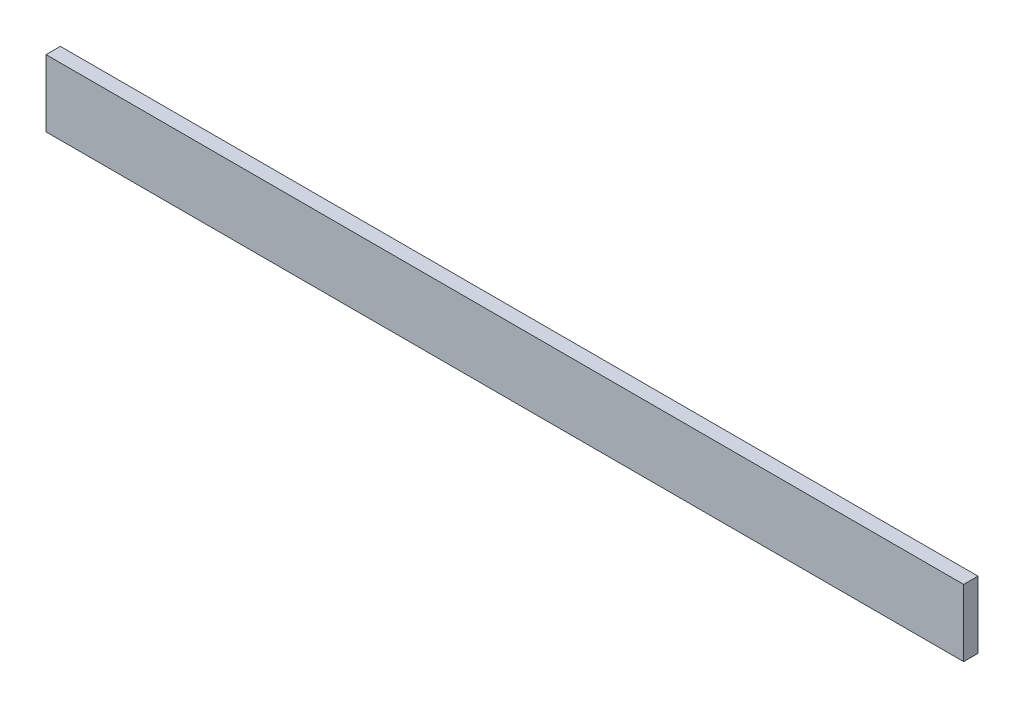
ISO-10303-21;
HEADER;
FILE_DESCRIPTION(('STEP AP214'),'2;1');
FILE_NAME('part.step','',(''),(''),'','','');
FILE_SCHEMA(('AUTOMOTIVE_DESIGN { 1 0 10303 214 1 1 1 1 }'));
ENDSEC;
DATA;
#1=APPLICATION_CONTEXT('core data for automotive mechanical design processes');
#2=APPLICATION_PROTOCOL_DEFINITION('international standard','automotive_design',2000,#1);
#3=PRODUCT_CONTEXT('',#1,'mechanical');
#4=PRODUCT('Part','Part','',(#3));
#5=PRODUCT_RELATED_PRODUCT_CATEGORY('part','',(#4));
#6=PRODUCT_DEFINITION_FORMATION('','',#4);
#7=PRODUCT_DEFINITION_CONTEXT('part definition',#1,'design');
#8=PRODUCT_DEFINITION('design','',#6,#7);
#9=PRODUCT_DEFINITION_SHAPE('','',#8);
#10=(LENGTH_UNIT() NAMED_UNIT(*) SI_UNIT(.MILLI.,.METRE.));
#11=(NAMED_UNIT(*) PLANE_ANGLE_UNIT() SI_UNIT($,.RADIAN.));
#12=(NAMED_UNIT(*) SI_UNIT($,.STERADIAN.) SOLID_ANGLE_UNIT());
#13=UNCERTAINTY_MEASURE_WITH_UNIT(LENGTH_MEASURE(1.E-05),#10,'distance_accuracy_value','');
#14=(GEOMETRIC_REPRESENTATION_CONTEXT(3) GLOBAL_UNCERTAINTY_ASSIGNED_CONTEXT((#13)) GLOBAL_UNIT_ASSIGNED_CONTEXT((#10,
#11,#12)) REPRESENTATION_CONTEXT('',''));
#15=CARTESIAN_POINT('',(0.,0.,0.));
#16=DIRECTION('',(0.,0.,1.));
#17=DIRECTION('',(1.,0.,0.));
#18=AXIS2_PLACEMENT_3D('',#15,#16,#17);
#19=CARTESIAN_POINT('',(-609.6,-44.45,-9.525));
#20=DIRECTION('',(0.,0.,-1.));
#21=DIRECTION('',(-1.,0.,0.));
#22=AXIS2_PLACEMENT_3D('',#19,#20,#21);
#23=PLANE('',#22);
#24=DIRECTION('',(1.,0.,0.));
#25=VECTOR('',#24,1.);
#26=CARTESIAN_POINT('',(-609.6,44.45,-9.525));
#27=LINE('',#26,#25);
#28=CARTESIAN_POINT('',(-609.6,44.45,-9.525));
#29=VERTEX_POINT('',#28);
#30=CARTESIAN_POINT('',(609.6,44.45,-9.525));
#31=VERTEX_POINT('',#30);
#32=EDGE_CURVE('E35',#29,#31,#27,.T.);
#33=ORIENTED_EDGE('',*,*,#32,.T.);
#34=DIRECTION('',(0.,1.,0.));
#35=VECTOR('',#34,1.);
#36=CARTESIAN_POINT('',(609.6,-44.45,-9.525));
#37=LINE('',#36,#35);
#38=CARTESIAN_POINT('',(609.6,-44.45,-9.525));
#39=VERTEX_POINT('',#38);
#40=EDGE_CURVE('E72',#39,#31,#37,.T.);
#41=ORIENTED_EDGE('',*,*,#40,.F.);
#42=DIRECTION('',(1.,0.,0.));
#43=VECTOR('',#42,1.);
#44=CARTESIAN_POINT('',(-609.6,-44.45,-9.525));
#45=LINE('',#44,#43);
#46=CARTESIAN_POINT('',(-609.6,-44.45,-9.525));
#47=VERTEX_POINT('',#46);
#48=EDGE_CURVE('E11',#47,#39,#45,.T.);
#49=ORIENTED_EDGE('',*,*,#48,.F.);
#50=DIRECTION('',(0.,1.,0.));
#51=VECTOR('',#50,1.);
#52=CARTESIAN_POINT('',(-609.6,-44.45,-9.525));
#53=LINE('',#52,#51);
#54=EDGE_CURVE('E73',#47,#29,#53,.T.);
#55=ORIENTED_EDGE('',*,*,#54,.T.);
#56=EDGE_LOOP('',(#33,#41,#49,#55));
#57=FACE_BOUND('',#56,.T.);
#58=ADVANCED_FACE('F32',(#57),#23,.T.);
#59=CARTESIAN_POINT('',(-609.6,-44.45,9.525));
#60=DIRECTION('',(0.,-1.,0.));
#61=DIRECTION('',(0.,0.,-1.));
#62=AXIS2_PLACEMENT_3D('',#59,#60,#61);
#63=PLANE('',#62);
#64=ORIENTED_EDGE('',*,*,#48,.T.);
#65=DIRECTION('',(0.,0.,-1.));
#66=VECTOR('',#65,1.);
#67=CARTESIAN_POINT('',(609.6,-44.45,9.525));
#68=LINE('',#67,#66);
#69=CARTESIAN_POINT('',(609.6,-44.45,9.525));
#70=VERTEX_POINT('',#69);
#71=EDGE_CURVE('E89',#70,#39,#68,.T.);
#72=ORIENTED_EDGE('',*,*,#71,.F.);
#73=DIRECTION('',(1.,0.,0.));
#74=VECTOR('',#73,1.);
#75=CARTESIAN_POINT('',(-609.6,-44.45,9.525));
#76=LINE('',#75,#74);
#77=CARTESIAN_POINT('',(-609.6,-44.45,9.525));
#78=VERTEX_POINT('',#77);
#79=EDGE_CURVE('E40',#78,#70,#76,.T.);
#80=ORIENTED_EDGE('',*,*,#79,.F.);
#81=DIRECTION('',(0.,0.,-1.));
#82=VECTOR('',#81,1.);
#83=CARTESIAN_POINT('',(-609.6,-44.45,9.525));
#84=LINE('',#83,#82);
#85=EDGE_CURVE('E78',#78,#47,#84,.T.);
#86=ORIENTED_EDGE('',*,*,#85,.T.);
#87=EDGE_LOOP('',(#64,#72,#80,#86));
#88=FACE_BOUND('',#87,.T.);
#89=ADVANCED_FACE('F104',(#88),#63,.T.);
#90=CARTESIAN_POINT('',(-609.6,-44.45,9.525));
#91=DIRECTION('',(0.,0.,1.));
#92=DIRECTION('',(1.,0.,0.));
#93=AXIS2_PLACEMENT_3D('',#90,#91,#92);
#94=PLANE('',#93);
#95=ORIENTED_EDGE('',*,*,#79,.T.);
#96=DIRECTION('',(0.,-1.,0.));
#97=VECTOR('',#96,1.);
#98=CARTESIAN_POINT('',(609.6,-44.45,9.525));
#99=LINE('',#98,#97);
#100=CARTESIAN_POINT('',(609.6,44.45,9.525));
#101=VERTEX_POINT('',#100);
#102=EDGE_CURVE('E85',#101,#70,#99,.T.);
#103=ORIENTED_EDGE('',*,*,#102,.F.);
#104=DIRECTION('',(1.,0.,0.));
#105=VECTOR('',#104,1.);
#106=CARTESIAN_POINT('',(-609.6,44.45,9.525));
#107=LINE('',#106,#105);
#108=CARTESIAN_POINT('',(-609.6,44.45,9.525));
#109=VERTEX_POINT('',#108);
#110=EDGE_CURVE('E77',#109,#101,#107,.T.);
#111=ORIENTED_EDGE('',*,*,#110,.F.);
#112=DIRECTION('',(0.,-1.,0.));
#113=VECTOR('',#112,1.);
#114=CARTESIAN_POINT('',(-609.6,-44.45,9.525));
#115=LINE('',#114,#113);
#116=EDGE_CURVE('E97',#109,#78,#115,.T.);
#117=ORIENTED_EDGE('',*,*,#116,.T.);
#118=EDGE_LOOP('',(#95,#103,#111,#117));
#119=FACE_BOUND('',#118,.T.);
#120=ADVANCED_FACE('F101',(#119),#94,.T.);
#121=CARTESIAN_POINT('',(-609.6,44.45,9.525));
#122=DIRECTION('',(0.,1.,0.));
#123=DIRECTION('',(0.,0.,1.));
#124=AXIS2_PLACEMENT_3D('',#121,#122,#123);
#125=PLANE('',#124);
#126=ORIENTED_EDGE('',*,*,#110,.T.);
#127=DIRECTION('',(0.,0.,1.));
#128=VECTOR('',#127,1.);
#129=CARTESIAN_POINT('',(609.6,44.45,9.525));
#130=LINE('',#129,#128);
#131=EDGE_CURVE('E80',#31,#101,#130,.T.);
#132=ORIENTED_EDGE('',*,*,#131,.F.);
#133=ORIENTED_EDGE('',*,*,#32,.F.);
#134=DIRECTION('',(0.,0.,1.));
#135=VECTOR('',#134,1.);
#136=CARTESIAN_POINT('',(-609.6,44.45,9.525));
#137=LINE('',#136,#135);
#138=EDGE_CURVE('E95',#29,#109,#137,.T.);
#139=ORIENTED_EDGE('',*,*,#138,.T.);
#140=EDGE_LOOP('',(#126,#132,#133,#139));
#141=FACE_BOUND('',#140,.T.);
#142=ADVANCED_FACE('F81',(#141),#125,.T.);
#143=CARTESIAN_POINT('',(-609.6,0.,0.));
#144=DIRECTION('',(-1.,0.,0.));
#145=DIRECTION('',(0.,0.,1.));
#146=AXIS2_PLACEMENT_3D('',#143,#144,#145);
#147=PLANE('',#146);
#148=ORIENTED_EDGE('',*,*,#54,.F.);
#149=ORIENTED_EDGE('',*,*,#85,.F.);
#150=ORIENTED_EDGE('',*,*,#116,.F.);
#151=ORIENTED_EDGE('',*,*,#138,.F.);
#152=EDGE_LOOP('',(#148,#149,#150,#151));
#153=FACE_BOUND('',#152,.T.);
#154=ADVANCED_FACE('F106',(#153),#147,.T.);
#155=CARTESIAN_POINT('',(609.6,0.,0.));
#156=DIRECTION('',(-1.,0.,0.));
#157=DIRECTION('',(0.,0.,1.));
#158=AXIS2_PLACEMENT_3D('',#155,#156,#157);
#159=PLANE('',#158);
#160=ORIENTED_EDGE('',*,*,#40,.T.);
#161=ORIENTED_EDGE('',*,*,#131,.T.);
#162=ORIENTED_EDGE('',*,*,#102,.T.);
#163=ORIENTED_EDGE('',*,*,#71,.T.);
#164=EDGE_LOOP('',(#160,#161,#162,#163));
#165=FACE_BOUND('',#164,.T.);
#166=ADVANCED_FACE('F88',(#165),#159,.F.);
#167=CLOSED_SHELL('',(#58,#89,#120,#142,#154,#166));
#168=MANIFOLD_SOLID_BREP('B2',#167);
#169=ADVANCED_BREP_SHAPE_REPRESENTATION('',(#18,#168),#14);
#170=SHAPE_DEFINITION_REPRESENTATION(#9,#169);
ENDSEC;
END-ISO-10303-21;
